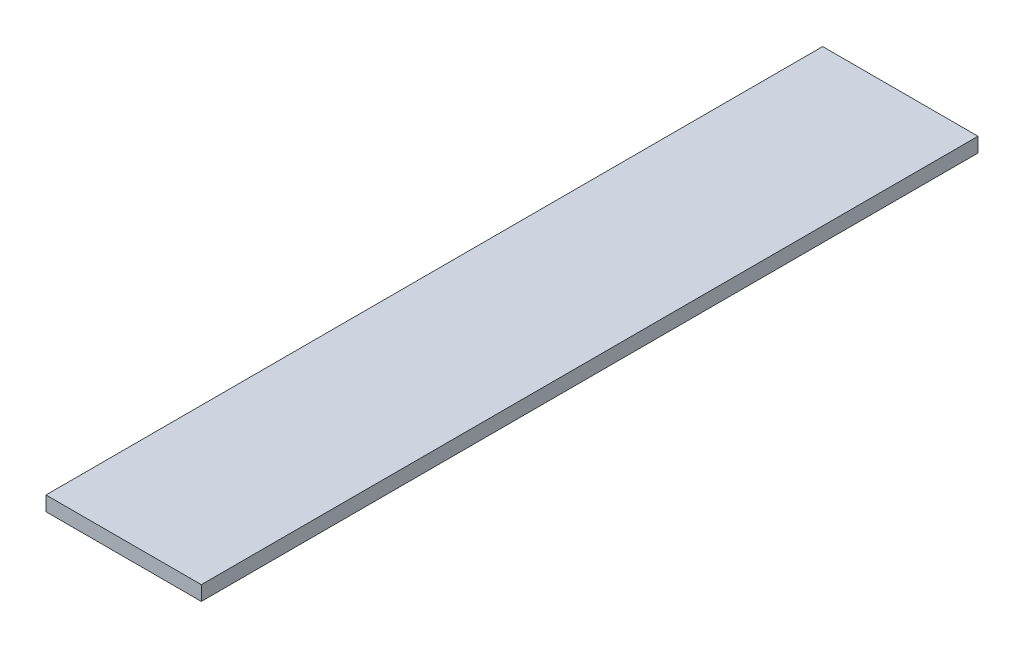
ISO-10303-21;
HEADER;
FILE_DESCRIPTION(('STEP AP214'),'2;1');
FILE_NAME('part.step','',(''),(''),'','','');
FILE_SCHEMA(('AUTOMOTIVE_DESIGN { 1 0 10303 214 1 1 1 1 }'));
ENDSEC;
DATA;
#1=APPLICATION_CONTEXT('core data for automotive mechanical design processes');
#2=APPLICATION_PROTOCOL_DEFINITION('international standard','automotive_design',2000,#1);
#3=PRODUCT_CONTEXT('',#1,'mechanical');
#4=PRODUCT('Part','Part','',(#3));
#5=PRODUCT_RELATED_PRODUCT_CATEGORY('part','',(#4));
#6=PRODUCT_DEFINITION_FORMATION('','',#4);
#7=PRODUCT_DEFINITION_CONTEXT('part definition',#1,'design');
#8=PRODUCT_DEFINITION('design','',#6,#7);
#9=PRODUCT_DEFINITION_SHAPE('','',#8);
#10=(LENGTH_UNIT() NAMED_UNIT(*) SI_UNIT(.MILLI.,.METRE.));
#11=(NAMED_UNIT(*) PLANE_ANGLE_UNIT() SI_UNIT($,.RADIAN.));
#12=(NAMED_UNIT(*) SI_UNIT($,.STERADIAN.) SOLID_ANGLE_UNIT());
#13=UNCERTAINTY_MEASURE_WITH_UNIT(LENGTH_MEASURE(1.E-05),#10,'distance_accuracy_value','');
#14=(GEOMETRIC_REPRESENTATION_CONTEXT(3) GLOBAL_UNCERTAINTY_ASSIGNED_CONTEXT((#13)) GLOBAL_UNIT_ASSIGNED_CONTEXT((#10,
#11,#12)) REPRESENTATION_CONTEXT('',''));
#15=CARTESIAN_POINT('',(0.,0.,0.));
#16=DIRECTION('',(0.,0.,1.));
#17=DIRECTION('',(1.,0.,0.));
#18=AXIS2_PLACEMENT_3D('',#15,#16,#17);
#19=CARTESIAN_POINT('',(0.,4.7625,0.));
#20=DIRECTION('',(1.,0.,0.));
#21=DIRECTION('',(0.,0.,-1.));
#22=AXIS2_PLACEMENT_3D('',#19,#20,#21);
#23=PLANE('',#22);
#24=DIRECTION('',(0.,0.,1.));
#25=VECTOR('',#24,1.);
#26=CARTESIAN_POINT('',(0.,0.,0.));
#27=LINE('',#26,#25);
#28=CARTESIAN_POINT('',(0.,0.,0.));
#29=VERTEX_POINT('',#28);
#30=CARTESIAN_POINT('',(0.,0.,254.));
#31=VERTEX_POINT('',#30);
#32=EDGE_CURVE('E96',#29,#31,#27,.T.);
#33=ORIENTED_EDGE('',*,*,#32,.T.);
#34=DIRECTION('',(0.,-1.,0.));
#35=VECTOR('',#34,1.);
#36=CARTESIAN_POINT('',(0.,4.7625,254.));
#37=LINE('',#36,#35);
#38=CARTESIAN_POINT('',(0.,4.7625,254.));
#39=VERTEX_POINT('',#38);
#40=EDGE_CURVE('E11',#39,#31,#37,.T.);
#41=ORIENTED_EDGE('',*,*,#40,.F.);
#42=DIRECTION('',(0.,0.,1.));
#43=VECTOR('',#42,1.);
#44=CARTESIAN_POINT('',(0.,4.7625,0.));
#45=LINE('',#44,#43);
#46=CARTESIAN_POINT('',(0.,4.7625,0.));
#47=VERTEX_POINT('',#46);
#48=EDGE_CURVE('E82',#47,#39,#45,.T.);
#49=ORIENTED_EDGE('',*,*,#48,.F.);
#50=DIRECTION('',(0.,-1.,0.));
#51=VECTOR('',#50,1.);
#52=CARTESIAN_POINT('',(0.,4.7625,0.));
#53=LINE('',#52,#51);
#54=EDGE_CURVE('E49',#47,#29,#53,.T.);
#55=ORIENTED_EDGE('',*,*,#54,.T.);
#56=EDGE_LOOP('',(#33,#41,#49,#55));
#57=FACE_BOUND('',#56,.T.);
#58=ADVANCED_FACE('F33',(#57),#23,.F.);
#59=CARTESIAN_POINT('',(0.,4.7625,254.));
#60=DIRECTION('',(0.,0.,-1.));
#61=DIRECTION('',(-1.,0.,0.));
#62=AXIS2_PLACEMENT_3D('',#59,#60,#61);
#63=PLANE('',#62);
#64=DIRECTION('',(1.,0.,0.));
#65=VECTOR('',#64,1.);
#66=CARTESIAN_POINT('',(0.,0.,254.));
#67=LINE('',#66,#65);
#68=CARTESIAN_POINT('',(50.8000000000001,0.,254.));
#69=VERTEX_POINT('',#68);
#70=EDGE_CURVE('E87',#31,#69,#67,.T.);
#71=ORIENTED_EDGE('',*,*,#70,.T.);
#72=DIRECTION('',(0.,-1.,0.));
#73=VECTOR('',#72,1.);
#74=CARTESIAN_POINT('',(50.8000000000001,4.7625,254.));
#75=LINE('',#74,#73);
#76=CARTESIAN_POINT('',(50.8000000000001,4.7625,254.));
#77=VERTEX_POINT('',#76);
#78=EDGE_CURVE('E41',#77,#69,#75,.T.);
#79=ORIENTED_EDGE('',*,*,#78,.F.);
#80=DIRECTION('',(1.,0.,0.));
#81=VECTOR('',#80,1.);
#82=CARTESIAN_POINT('',(0.,4.7625,254.));
#83=LINE('',#82,#81);
#84=EDGE_CURVE('E74',#39,#77,#83,.T.);
#85=ORIENTED_EDGE('',*,*,#84,.F.);
#86=ORIENTED_EDGE('',*,*,#40,.T.);
#87=EDGE_LOOP('',(#71,#79,#85,#86));
#88=FACE_BOUND('',#87,.T.);
#89=ADVANCED_FACE('F86',(#88),#63,.F.);
#90=CARTESIAN_POINT('',(50.8,4.7625,0.));
#91=DIRECTION('',(1.,0.,0.));
#92=DIRECTION('',(0.,0.,-1.));
#93=AXIS2_PLACEMENT_3D('',#90,#91,#92);
#94=PLANE('',#93);
#95=DIRECTION('',(0.,0.,1.));
#96=VECTOR('',#95,1.);
#97=CARTESIAN_POINT('',(50.8,0.,0.));
#98=LINE('',#97,#96);
#99=CARTESIAN_POINT('',(50.8,0.,0.));
#100=VERTEX_POINT('',#99);
#101=EDGE_CURVE('E99',#100,#69,#98,.T.);
#102=ORIENTED_EDGE('',*,*,#101,.F.);
#103=DIRECTION('',(0.,-1.,0.));
#104=VECTOR('',#103,1.);
#105=CARTESIAN_POINT('',(50.8,4.7625,0.));
#106=LINE('',#105,#104);
#107=CARTESIAN_POINT('',(50.8,4.7625,0.));
#108=VERTEX_POINT('',#107);
#109=EDGE_CURVE('E63',#108,#100,#106,.T.);
#110=ORIENTED_EDGE('',*,*,#109,.F.);
#111=DIRECTION('',(0.,0.,1.));
#112=VECTOR('',#111,1.);
#113=CARTESIAN_POINT('',(50.8,4.7625,0.));
#114=LINE('',#113,#112);
#115=EDGE_CURVE('E81',#108,#77,#114,.T.);
#116=ORIENTED_EDGE('',*,*,#115,.T.);
#117=ORIENTED_EDGE('',*,*,#78,.T.);
#118=EDGE_LOOP('',(#102,#110,#116,#117));
#119=FACE_BOUND('',#118,.T.);
#120=ADVANCED_FACE('F90',(#119),#94,.T.);
#121=CARTESIAN_POINT('',(0.,4.7625,0.));
#122=DIRECTION('',(0.,0.,-1.));
#123=DIRECTION('',(-1.,0.,0.));
#124=AXIS2_PLACEMENT_3D('',#121,#122,#123);
#125=PLANE('',#124);
#126=DIRECTION('',(1.,0.,0.));
#127=VECTOR('',#126,1.);
#128=CARTESIAN_POINT('',(0.,0.,0.));
#129=LINE('',#128,#127);
#130=EDGE_CURVE('E101',#29,#100,#129,.T.);
#131=ORIENTED_EDGE('',*,*,#130,.F.);
#132=ORIENTED_EDGE('',*,*,#54,.F.);
#133=DIRECTION('',(1.,0.,0.));
#134=VECTOR('',#133,1.);
#135=CARTESIAN_POINT('',(0.,4.7625,0.));
#136=LINE('',#135,#134);
#137=EDGE_CURVE('E91',#47,#108,#136,.T.);
#138=ORIENTED_EDGE('',*,*,#137,.T.);
#139=ORIENTED_EDGE('',*,*,#109,.T.);
#140=EDGE_LOOP('',(#131,#132,#138,#139));
#141=FACE_BOUND('',#140,.T.);
#142=ADVANCED_FACE('F107',(#141),#125,.T.);
#143=CARTESIAN_POINT('',(0.,4.7625,0.));
#144=DIRECTION('',(0.,1.,0.));
#145=DIRECTION('',(0.,0.,1.));
#146=AXIS2_PLACEMENT_3D('',#143,#144,#145);
#147=PLANE('',#146);
#148=ORIENTED_EDGE('',*,*,#48,.T.);
#149=ORIENTED_EDGE('',*,*,#84,.T.);
#150=ORIENTED_EDGE('',*,*,#115,.F.);
#151=ORIENTED_EDGE('',*,*,#137,.F.);
#152=EDGE_LOOP('',(#148,#149,#150,#151));
#153=FACE_BOUND('',#152,.T.);
#154=ADVANCED_FACE('F78',(#153),#147,.T.);
#155=CARTESIAN_POINT('',(0.,0.,0.));
#156=DIRECTION('',(0.,1.,0.));
#157=DIRECTION('',(0.,0.,1.));
#158=AXIS2_PLACEMENT_3D('',#155,#156,#157);
#159=PLANE('',#158);
#160=ORIENTED_EDGE('',*,*,#32,.F.);
#161=ORIENTED_EDGE('',*,*,#130,.T.);
#162=ORIENTED_EDGE('',*,*,#101,.T.);
#163=ORIENTED_EDGE('',*,*,#70,.F.);
#164=EDGE_LOOP('',(#160,#161,#162,#163));
#165=FACE_BOUND('',#164,.T.);
#166=ADVANCED_FACE('F106',(#165),#159,.F.);
#167=CLOSED_SHELL('',(#58,#89,#120,#142,#154,#166));
#168=MANIFOLD_SOLID_BREP('B2',#167);
#169=ADVANCED_BREP_SHAPE_REPRESENTATION('',(#18,#168),#14);
#170=SHAPE_DEFINITION_REPRESENTATION(#9,#169);
ENDSEC;
END-ISO-10303-21;
